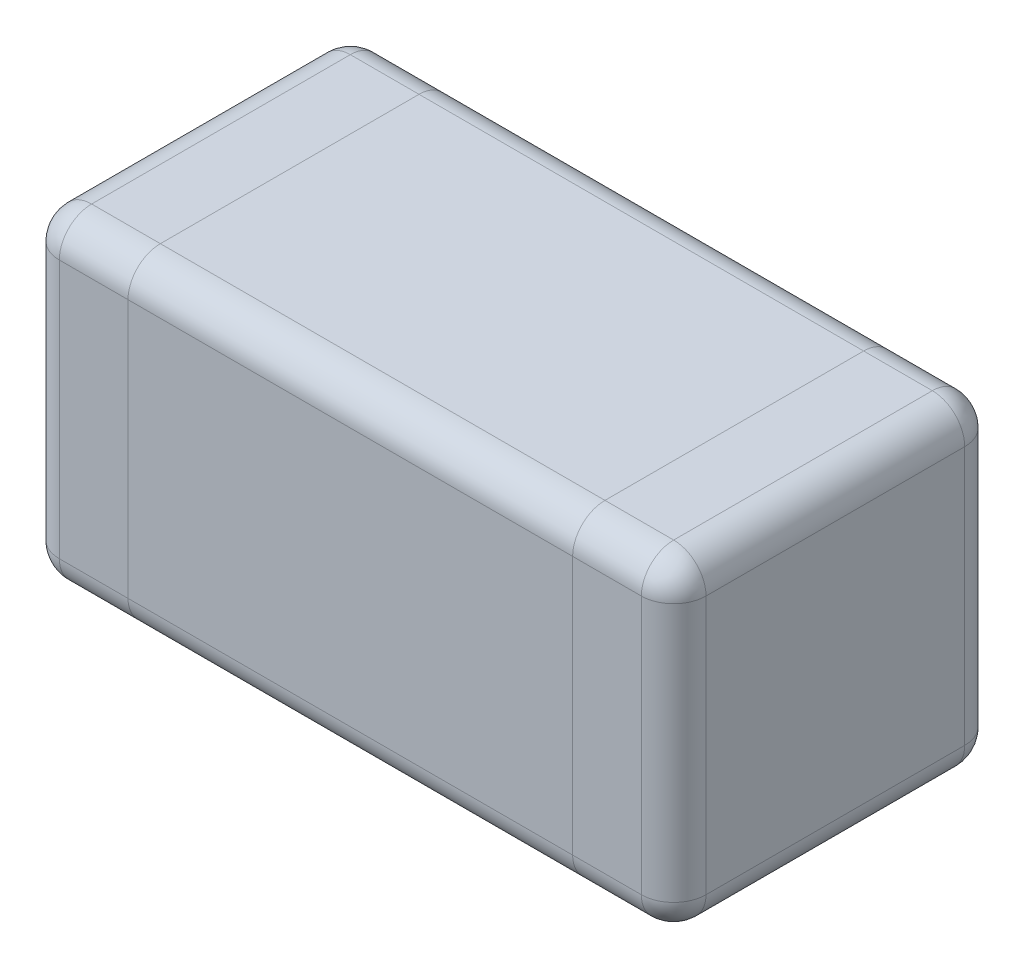
ISO-10303-21;
HEADER;
FILE_DESCRIPTION(('STEP AP214'),'2;1');
FILE_NAME('part.step','',(''),(''),'','','');
FILE_SCHEMA(('AUTOMOTIVE_DESIGN { 1 0 10303 214 1 1 1 1 }'));
ENDSEC;
DATA;
#1=APPLICATION_CONTEXT('core data for automotive mechanical design processes');
#2=APPLICATION_PROTOCOL_DEFINITION('international standard','automotive_design',2000,#1);
#3=PRODUCT_CONTEXT('',#1,'mechanical');
#4=PRODUCT('Part','Part','',(#3));
#5=PRODUCT_RELATED_PRODUCT_CATEGORY('part','',(#4));
#6=PRODUCT_DEFINITION_FORMATION('','',#4);
#7=PRODUCT_DEFINITION_CONTEXT('part definition',#1,'design');
#8=PRODUCT_DEFINITION('design','',#6,#7);
#9=PRODUCT_DEFINITION_SHAPE('','',#8);
#10=(LENGTH_UNIT() NAMED_UNIT(*) SI_UNIT(.MILLI.,.METRE.));
#11=(NAMED_UNIT(*) PLANE_ANGLE_UNIT() SI_UNIT($,.RADIAN.));
#12=(NAMED_UNIT(*) SI_UNIT($,.STERADIAN.) SOLID_ANGLE_UNIT());
#13=UNCERTAINTY_MEASURE_WITH_UNIT(LENGTH_MEASURE(1.E-05),#10,'distance_accuracy_value','');
#14=(GEOMETRIC_REPRESENTATION_CONTEXT(3) GLOBAL_UNCERTAINTY_ASSIGNED_CONTEXT((#13)) GLOBAL_UNIT_ASSIGNED_CONTEXT((#10,
#11,#12)) REPRESENTATION_CONTEXT('',''));
#15=CARTESIAN_POINT('',(0.,0.,0.));
#16=DIRECTION('',(0.,0.,1.));
#17=DIRECTION('',(1.,0.,0.));
#18=AXIS2_PLACEMENT_3D('',#15,#16,#17);
#19=CARTESIAN_POINT('',(0.,0.08,-0.08));
#20=DIRECTION('',(-1.,0.,0.));
#21=DIRECTION('',(0.,0.,1.));
#22=AXIS2_PLACEMENT_3D('',#19,#20,#21);
#23=CYLINDRICAL_SURFACE('',#22,0.08);
#24=DIRECTION('',(1.,0.,0.));
#25=VECTOR('',#24,1.);
#26=CARTESIAN_POINT('',(1.6,0.08,0.));
#27=LINE('',#26,#25);
#28=CARTESIAN_POINT('',(1.35,0.08,0.));
#29=VERTEX_POINT('',#28);
#30=CARTESIAN_POINT('',(1.52,0.08,0.));
#31=VERTEX_POINT('',#30);
#32=EDGE_CURVE('E233',#29,#31,#27,.T.);
#33=ORIENTED_EDGE('',*,*,#32,.F.);
#34=CARTESIAN_POINT('',(1.35,0.08,-0.08));
#35=DIRECTION('',(-1.,0.,0.));
#36=DIRECTION('',(0.,0.,1.));
#37=AXIS2_PLACEMENT_3D('',#34,#35,#36);
#38=CIRCLE('',#37,0.08);
#39=CARTESIAN_POINT('',(1.35,0.,-0.08));
#40=VERTEX_POINT('',#39);
#41=EDGE_CURVE('E12',#29,#40,#38,.F.);
#42=ORIENTED_EDGE('',*,*,#41,.T.);
#43=DIRECTION('',(1.,0.,0.));
#44=VECTOR('',#43,1.);
#45=CARTESIAN_POINT('',(0.,0.,-0.08));
#46=LINE('',#45,#44);
#47=CARTESIAN_POINT('',(1.52,0.,-0.08));
#48=VERTEX_POINT('',#47);
#49=EDGE_CURVE('E270',#48,#40,#46,.F.);
#50=ORIENTED_EDGE('',*,*,#49,.F.);
#51=CARTESIAN_POINT('',(1.52,0.08,-0.08));
#52=DIRECTION('',(1.,0.,0.));
#53=DIRECTION('',(0.,0.,-1.));
#54=AXIS2_PLACEMENT_3D('',#51,#52,#53);
#55=CIRCLE('',#54,0.08);
#56=EDGE_CURVE('E292',#31,#48,#55,.T.);
#57=ORIENTED_EDGE('',*,*,#56,.F.);
#58=EDGE_LOOP('',(#33,#42,#50,#57));
#59=FACE_BOUND('',#58,.T.);
#60=ADVANCED_FACE('F39',(#59),#23,.T.);
#61=CARTESIAN_POINT('',(0.,0.,0.));
#62=DIRECTION('',(0.,-1.,0.));
#63=DIRECTION('',(0.,0.,-1.));
#64=AXIS2_PLACEMENT_3D('',#61,#62,#63);
#65=PLANE('',#64);
#66=ORIENTED_EDGE('',*,*,#49,.T.);
#67=DIRECTION('',(0.,0.,-1.));
#68=VECTOR('',#67,1.);
#69=CARTESIAN_POINT('',(1.35,0.,0.));
#70=LINE('',#69,#68);
#71=CARTESIAN_POINT('',(1.35,0.,-0.719999999999999));
#72=VERTEX_POINT('',#71);
#73=EDGE_CURVE('E49',#40,#72,#70,.T.);
#74=ORIENTED_EDGE('',*,*,#73,.T.);
#75=DIRECTION('',(-1.,0.,0.));
#76=VECTOR('',#75,1.);
#77=CARTESIAN_POINT('',(1.6,0.,-0.719999999999999));
#78=LINE('',#77,#76);
#79=CARTESIAN_POINT('',(1.52,0.,-0.719999999999999));
#80=VERTEX_POINT('',#79);
#81=EDGE_CURVE('E262',#72,#80,#78,.F.);
#82=ORIENTED_EDGE('',*,*,#81,.T.);
#83=DIRECTION('',(0.,0.,-1.));
#84=VECTOR('',#83,1.);
#85=CARTESIAN_POINT('',(1.52,0.,0.));
#86=LINE('',#85,#84);
#87=EDGE_CURVE('E266',#80,#48,#86,.F.);
#88=ORIENTED_EDGE('',*,*,#87,.T.);
#89=EDGE_LOOP('',(#66,#74,#82,#88));
#90=FACE_BOUND('',#89,.T.);
#91=ADVANCED_FACE('F481',(#90),#65,.T.);
#92=CARTESIAN_POINT('',(0.,0.08,-0.719999999999999));
#93=DIRECTION('',(1.,0.,0.));
#94=DIRECTION('',(0.,0.,-1.));
#95=AXIS2_PLACEMENT_3D('',#92,#93,#94);
#96=CYLINDRICAL_SURFACE('',#95,0.08);
#97=ORIENTED_EDGE('',*,*,#81,.F.);
#98=CARTESIAN_POINT('',(1.35,0.08,-0.719999999999999));
#99=DIRECTION('',(-1.,0.,0.));
#100=DIRECTION('',(0.,0.,1.));
#101=AXIS2_PLACEMENT_3D('',#98,#99,#100);
#102=CIRCLE('',#101,0.08);
#103=CARTESIAN_POINT('',(1.35,0.08,-0.799999999999999));
#104=VERTEX_POINT('',#103);
#105=EDGE_CURVE('E377',#72,#104,#102,.F.);
#106=ORIENTED_EDGE('',*,*,#105,.T.);
#107=DIRECTION('',(-1.,0.,0.));
#108=VECTOR('',#107,1.);
#109=CARTESIAN_POINT('',(0.,0.08,-0.799999999999999));
#110=LINE('',#109,#108);
#111=CARTESIAN_POINT('',(1.52,0.08,-0.799999999999999));
#112=VERTEX_POINT('',#111);
#113=EDGE_CURVE('E247',#112,#104,#110,.T.);
#114=ORIENTED_EDGE('',*,*,#113,.F.);
#115=CARTESIAN_POINT('',(1.52,0.08,-0.719999999999999));
#116=DIRECTION('',(1.,0.,0.));
#117=DIRECTION('',(0.,0.,-1.));
#118=AXIS2_PLACEMENT_3D('',#115,#116,#117);
#119=CIRCLE('',#118,0.08);
#120=EDGE_CURVE('E315',#80,#112,#119,.T.);
#121=ORIENTED_EDGE('',*,*,#120,.F.);
#122=EDGE_LOOP('',(#97,#106,#114,#121));
#123=FACE_BOUND('',#122,.T.);
#124=ADVANCED_FACE('F433',(#123),#96,.T.);
#125=CARTESIAN_POINT('',(0.,0.8,-0.799999999999999));
#126=DIRECTION('',(0.,0.,1.));
#127=DIRECTION('',(1.,0.,0.));
#128=AXIS2_PLACEMENT_3D('',#125,#126,#127);
#129=PLANE('',#128);
#130=DIRECTION('',(0.,-1.,0.));
#131=VECTOR('',#130,1.);
#132=CARTESIAN_POINT('',(1.35,0.8,-0.799999999999999));
#133=LINE('',#132,#131);
#134=CARTESIAN_POINT('',(1.35,0.72,-0.799999999999999));
#135=VERTEX_POINT('',#134);
#136=EDGE_CURVE('E380',#135,#104,#133,.T.);
#137=ORIENTED_EDGE('',*,*,#136,.F.);
#138=DIRECTION('',(-1.,0.,0.));
#139=VECTOR('',#138,1.);
#140=CARTESIAN_POINT('',(0.,0.72,-0.799999999999999));
#141=LINE('',#140,#139);
#142=CARTESIAN_POINT('',(1.52,0.72,-0.799999999999999));
#143=VERTEX_POINT('',#142);
#144=EDGE_CURVE('E237',#135,#143,#141,.F.);
#145=ORIENTED_EDGE('',*,*,#144,.T.);
#146=DIRECTION('',(0.,-1.,0.));
#147=VECTOR('',#146,1.);
#148=CARTESIAN_POINT('',(1.52,0.8,-0.799999999999999));
#149=LINE('',#148,#147);
#150=EDGE_CURVE('E196',#143,#112,#149,.T.);
#151=ORIENTED_EDGE('',*,*,#150,.T.);
#152=ORIENTED_EDGE('',*,*,#113,.T.);
#153=EDGE_LOOP('',(#137,#145,#151,#152));
#154=FACE_BOUND('',#153,.T.);
#155=ADVANCED_FACE('F435',(#154),#129,.F.);
#156=CARTESIAN_POINT('',(0.,0.72,-0.719999999999999));
#157=DIRECTION('',(-1.,0.,0.));
#158=DIRECTION('',(0.,0.,1.));
#159=AXIS2_PLACEMENT_3D('',#156,#157,#158);
#160=CYLINDRICAL_SURFACE('',#159,0.08);
#161=ORIENTED_EDGE('',*,*,#144,.F.);
#162=CARTESIAN_POINT('',(1.35,0.72,-0.719999999999999));
#163=DIRECTION('',(-1.,0.,0.));
#164=DIRECTION('',(0.,0.,1.));
#165=AXIS2_PLACEMENT_3D('',#162,#163,#164);
#166=CIRCLE('',#165,0.08);
#167=CARTESIAN_POINT('',(1.35,0.8,-0.719999999999999));
#168=VERTEX_POINT('',#167);
#169=EDGE_CURVE('E373',#135,#168,#166,.F.);
#170=ORIENTED_EDGE('',*,*,#169,.T.);
#171=DIRECTION('',(-1.,0.,0.));
#172=VECTOR('',#171,1.);
#173=CARTESIAN_POINT('',(0.,0.8,-0.719999999999999));
#174=LINE('',#173,#172);
#175=CARTESIAN_POINT('',(1.52,0.8,-0.719999999999999));
#176=VERTEX_POINT('',#175);
#177=EDGE_CURVE('E283',#176,#168,#174,.T.);
#178=ORIENTED_EDGE('',*,*,#177,.F.);
#179=CARTESIAN_POINT('',(1.52,0.72,-0.719999999999999));
#180=DIRECTION('',(1.,0.,0.));
#181=DIRECTION('',(0.,0.,-1.));
#182=AXIS2_PLACEMENT_3D('',#179,#180,#181);
#183=CIRCLE('',#182,0.08);
#184=EDGE_CURVE('E200',#143,#176,#183,.T.);
#185=ORIENTED_EDGE('',*,*,#184,.F.);
#186=EDGE_LOOP('',(#161,#170,#178,#185));
#187=FACE_BOUND('',#186,.T.);
#188=ADVANCED_FACE('F465',(#187),#160,.T.);
#189=CARTESIAN_POINT('',(0.,0.8,0.));
#190=DIRECTION('',(0.,-1.,0.));
#191=DIRECTION('',(0.,0.,-1.));
#192=AXIS2_PLACEMENT_3D('',#189,#190,#191);
#193=PLANE('',#192);
#194=DIRECTION('',(0.,0.,-1.));
#195=VECTOR('',#194,1.);
#196=CARTESIAN_POINT('',(1.35,0.8,0.));
#197=LINE('',#196,#195);
#198=CARTESIAN_POINT('',(1.35,0.8,-0.08));
#199=VERTEX_POINT('',#198);
#200=EDGE_CURVE('E369',#199,#168,#197,.T.);
#201=ORIENTED_EDGE('',*,*,#200,.F.);
#202=DIRECTION('',(1.,0.,0.));
#203=VECTOR('',#202,1.);
#204=CARTESIAN_POINT('',(0.,0.8,-0.08));
#205=LINE('',#204,#203);
#206=CARTESIAN_POINT('',(1.52,0.8,-0.08));
#207=VERTEX_POINT('',#206);
#208=EDGE_CURVE('E275',#199,#207,#205,.T.);
#209=ORIENTED_EDGE('',*,*,#208,.T.);
#210=DIRECTION('',(0.,0.,-1.));
#211=VECTOR('',#210,1.);
#212=CARTESIAN_POINT('',(1.52,0.8,0.));
#213=LINE('',#212,#211);
#214=EDGE_CURVE('E279',#207,#176,#213,.T.);
#215=ORIENTED_EDGE('',*,*,#214,.T.);
#216=ORIENTED_EDGE('',*,*,#177,.T.);
#217=EDGE_LOOP('',(#201,#209,#215,#216));
#218=FACE_BOUND('',#217,.T.);
#219=ADVANCED_FACE('F464',(#218),#193,.F.);
#220=CARTESIAN_POINT('',(0.,0.72,-0.08));
#221=DIRECTION('',(1.,0.,0.));
#222=DIRECTION('',(0.,0.,-1.));
#223=AXIS2_PLACEMENT_3D('',#220,#221,#222);
#224=CYLINDRICAL_SURFACE('',#223,0.08);
#225=ORIENTED_EDGE('',*,*,#208,.F.);
#226=CARTESIAN_POINT('',(1.35,0.72,-0.08));
#227=DIRECTION('',(-1.,0.,0.));
#228=DIRECTION('',(0.,0.,1.));
#229=AXIS2_PLACEMENT_3D('',#226,#227,#228);
#230=CIRCLE('',#229,0.08);
#231=CARTESIAN_POINT('',(1.35,0.72,0.));
#232=VERTEX_POINT('',#231);
#233=EDGE_CURVE('E374',#199,#232,#230,.F.);
#234=ORIENTED_EDGE('',*,*,#233,.T.);
#235=DIRECTION('',(1.,0.,0.));
#236=VECTOR('',#235,1.);
#237=CARTESIAN_POINT('',(0.,0.72,0.));
#238=LINE('',#237,#236);
#239=CARTESIAN_POINT('',(1.52,0.72,0.));
#240=VERTEX_POINT('',#239);
#241=EDGE_CURVE('E224',#240,#232,#238,.F.);
#242=ORIENTED_EDGE('',*,*,#241,.F.);
#243=CARTESIAN_POINT('',(1.52,0.72,-0.08));
#244=DIRECTION('',(1.,0.,0.));
#245=DIRECTION('',(0.,0.,-1.));
#246=AXIS2_PLACEMENT_3D('',#243,#244,#245);
#247=CIRCLE('',#246,0.08);
#248=EDGE_CURVE('E299',#207,#240,#247,.T.);
#249=ORIENTED_EDGE('',*,*,#248,.F.);
#250=EDGE_LOOP('',(#225,#234,#242,#249));
#251=FACE_BOUND('',#250,.T.);
#252=ADVANCED_FACE('F411',(#251),#224,.T.);
#253=CARTESIAN_POINT('',(0.,0.8,0.));
#254=DIRECTION('',(0.,0.,-1.));
#255=DIRECTION('',(-1.,0.,0.));
#256=AXIS2_PLACEMENT_3D('',#253,#254,#255);
#257=PLANE('',#256);
#258=DIRECTION('',(0.,1.,0.));
#259=VECTOR('',#258,1.);
#260=CARTESIAN_POINT('',(1.35,0.8,0.));
#261=LINE('',#260,#259);
#262=EDGE_CURVE('E43',#29,#232,#261,.T.);
#263=ORIENTED_EDGE('',*,*,#262,.F.);
#264=ORIENTED_EDGE('',*,*,#32,.T.);
#265=DIRECTION('',(0.,-1.,0.));
#266=VECTOR('',#265,1.);
#267=CARTESIAN_POINT('',(1.52,0.8,0.));
#268=LINE('',#267,#266);
#269=EDGE_CURVE('E230',#31,#240,#268,.F.);
#270=ORIENTED_EDGE('',*,*,#269,.T.);
#271=ORIENTED_EDGE('',*,*,#241,.T.);
#272=EDGE_LOOP('',(#263,#264,#270,#271));
#273=FACE_BOUND('',#272,.T.);
#274=ADVANCED_FACE('F408',(#273),#257,.F.);
#275=ORIENTED_EDGE('',*,*,#41,.F.);
#276=CARTESIAN_POINT('',(0.25,0.08,0.));
#277=VERTEX_POINT('',#276);
#278=EDGE_CURVE('E238',#277,#29,#27,.T.);
#279=ORIENTED_EDGE('',*,*,#278,.F.);
#280=CARTESIAN_POINT('',(0.25,0.08,-0.08));
#281=DIRECTION('',(-1.,0.,0.));
#282=DIRECTION('',(0.,0.,1.));
#283=AXIS2_PLACEMENT_3D('',#280,#281,#282);
#284=CIRCLE('',#283,0.08);
#285=CARTESIAN_POINT('',(0.25,0.,-0.08));
#286=VERTEX_POINT('',#285);
#287=EDGE_CURVE('E348',#277,#286,#284,.F.);
#288=ORIENTED_EDGE('',*,*,#287,.T.);
#289=EDGE_CURVE('E273',#40,#286,#46,.F.);
#290=ORIENTED_EDGE('',*,*,#289,.F.);
#291=EDGE_LOOP('',(#275,#279,#288,#290));
#292=FACE_BOUND('',#291,.T.);
#293=ADVANCED_FACE('F483',(#292),#23,.T.);
#294=ORIENTED_EDGE('',*,*,#73,.F.);
#295=ORIENTED_EDGE('',*,*,#289,.T.);
#296=DIRECTION('',(0.,0.,-1.));
#297=VECTOR('',#296,1.);
#298=CARTESIAN_POINT('',(0.25,0.,0.));
#299=LINE('',#298,#297);
#300=CARTESIAN_POINT('',(0.25,0.,-0.719999999999999));
#301=VERTEX_POINT('',#300);
#302=EDGE_CURVE('E345',#286,#301,#299,.T.);
#303=ORIENTED_EDGE('',*,*,#302,.T.);
#304=EDGE_CURVE('E267',#301,#72,#78,.F.);
#305=ORIENTED_EDGE('',*,*,#304,.T.);
#306=EDGE_LOOP('',(#294,#295,#303,#305));
#307=FACE_BOUND('',#306,.T.);
#308=ADVANCED_FACE('F489',(#307),#65,.T.);
#309=ORIENTED_EDGE('',*,*,#105,.F.);
#310=ORIENTED_EDGE('',*,*,#304,.F.);
#311=CARTESIAN_POINT('',(0.25,0.08,-0.719999999999999));
#312=DIRECTION('',(-1.,0.,0.));
#313=DIRECTION('',(0.,0.,1.));
#314=AXIS2_PLACEMENT_3D('',#311,#312,#313);
#315=CIRCLE('',#314,0.08);
#316=CARTESIAN_POINT('',(0.25,0.08,-0.799999999999999));
#317=VERTEX_POINT('',#316);
#318=EDGE_CURVE('E349',#301,#317,#315,.F.);
#319=ORIENTED_EDGE('',*,*,#318,.T.);
#320=EDGE_CURVE('E251',#104,#317,#110,.T.);
#321=ORIENTED_EDGE('',*,*,#320,.F.);
#322=EDGE_LOOP('',(#309,#310,#319,#321));
#323=FACE_BOUND('',#322,.T.);
#324=ADVANCED_FACE('F530',(#323),#96,.T.);
#325=CARTESIAN_POINT('',(0.25,0.72,-0.799999999999999));
#326=VERTEX_POINT('',#325);
#327=EDGE_CURVE('E243',#326,#135,#141,.F.);
#328=ORIENTED_EDGE('',*,*,#327,.T.);
#329=ORIENTED_EDGE('',*,*,#136,.T.);
#330=ORIENTED_EDGE('',*,*,#320,.T.);
#331=DIRECTION('',(0.,-1.,0.));
#332=VECTOR('',#331,1.);
#333=CARTESIAN_POINT('',(0.25,0.8,-0.799999999999999));
#334=LINE('',#333,#332);
#335=EDGE_CURVE('E353',#326,#317,#334,.T.);
#336=ORIENTED_EDGE('',*,*,#335,.F.);
#337=EDGE_LOOP('',(#328,#329,#330,#336));
#338=FACE_BOUND('',#337,.T.);
#339=ADVANCED_FACE('F442',(#338),#129,.F.);
#340=ORIENTED_EDGE('',*,*,#169,.F.);
#341=ORIENTED_EDGE('',*,*,#327,.F.);
#342=CARTESIAN_POINT('',(0.25,0.72,-0.719999999999999));
#343=DIRECTION('',(-1.,0.,0.));
#344=DIRECTION('',(0.,0.,1.));
#345=AXIS2_PLACEMENT_3D('',#342,#343,#344);
#346=CIRCLE('',#345,0.08);
#347=CARTESIAN_POINT('',(0.25,0.8,-0.719999999999999));
#348=VERTEX_POINT('',#347);
#349=EDGE_CURVE('E343',#326,#348,#346,.F.);
#350=ORIENTED_EDGE('',*,*,#349,.T.);
#351=EDGE_CURVE('E287',#168,#348,#174,.T.);
#352=ORIENTED_EDGE('',*,*,#351,.F.);
#353=EDGE_LOOP('',(#340,#341,#350,#352));
#354=FACE_BOUND('',#353,.T.);
#355=ADVANCED_FACE('F446',(#354),#160,.T.);
#356=CARTESIAN_POINT('',(0.25,0.8,-0.08));
#357=VERTEX_POINT('',#356);
#358=EDGE_CURVE('E280',#357,#199,#205,.T.);
#359=ORIENTED_EDGE('',*,*,#358,.T.);
#360=ORIENTED_EDGE('',*,*,#200,.T.);
#361=ORIENTED_EDGE('',*,*,#351,.T.);
#362=DIRECTION('',(0.,0.,-1.));
#363=VECTOR('',#362,1.);
#364=CARTESIAN_POINT('',(0.25,0.8,0.));
#365=LINE('',#364,#363);
#366=EDGE_CURVE('E339',#357,#348,#365,.T.);
#367=ORIENTED_EDGE('',*,*,#366,.F.);
#368=EDGE_LOOP('',(#359,#360,#361,#367));
#369=FACE_BOUND('',#368,.T.);
#370=ADVANCED_FACE('F461',(#369),#193,.F.);
#371=ORIENTED_EDGE('',*,*,#233,.F.);
#372=ORIENTED_EDGE('',*,*,#358,.F.);
#373=CARTESIAN_POINT('',(0.25,0.72,-0.08));
#374=DIRECTION('',(-1.,0.,0.));
#375=DIRECTION('',(0.,0.,1.));
#376=AXIS2_PLACEMENT_3D('',#373,#374,#375);
#377=CIRCLE('',#376,0.08);
#378=CARTESIAN_POINT('',(0.25,0.72,0.));
#379=VERTEX_POINT('',#378);
#380=EDGE_CURVE('E344',#357,#379,#377,.F.);
#381=ORIENTED_EDGE('',*,*,#380,.T.);
#382=EDGE_CURVE('E228',#232,#379,#238,.F.);
#383=ORIENTED_EDGE('',*,*,#382,.F.);
#384=EDGE_LOOP('',(#371,#372,#381,#383));
#385=FACE_BOUND('',#384,.T.);
#386=ADVANCED_FACE('F405',(#385),#224,.T.);
#387=ORIENTED_EDGE('',*,*,#278,.T.);
#388=ORIENTED_EDGE('',*,*,#262,.T.);
#389=ORIENTED_EDGE('',*,*,#382,.T.);
#390=DIRECTION('',(0.,1.,0.));
#391=VECTOR('',#390,1.);
#392=CARTESIAN_POINT('',(0.25,0.8,0.));
#393=LINE('',#392,#391);
#394=EDGE_CURVE('E286',#277,#379,#393,.T.);
#395=ORIENTED_EDGE('',*,*,#394,.F.);
#396=EDGE_LOOP('',(#387,#388,#389,#395));
#397=FACE_BOUND('',#396,.T.);
#398=ADVANCED_FACE('F400',(#397),#257,.F.);
#399=CARTESIAN_POINT('',(0.,0.8,0.));
#400=DIRECTION('',(1.,0.,0.));
#401=DIRECTION('',(0.,0.,-1.));
#402=AXIS2_PLACEMENT_3D('',#399,#400,#401);
#403=PLANE('',#402);
#404=DIRECTION('',(0.,-1.,0.));
#405=VECTOR('',#404,1.);
#406=CARTESIAN_POINT('',(0.,0.8,-0.719999999999999));
#407=LINE('',#406,#405);
#408=CARTESIAN_POINT('',(0.,0.72,-0.719999999999999));
#409=VERTEX_POINT('',#408);
#410=CARTESIAN_POINT('',(0.,0.08,-0.719999999999999));
#411=VERTEX_POINT('',#410);
#412=EDGE_CURVE('E255',#409,#411,#407,.T.);
#413=ORIENTED_EDGE('',*,*,#412,.T.);
#414=DIRECTION('',(0.,0.,1.));
#415=VECTOR('',#414,1.);
#416=CARTESIAN_POINT('',(0.,0.08,0.));
#417=LINE('',#416,#415);
#418=CARTESIAN_POINT('',(0.,0.08,-0.08));
#419=VERTEX_POINT('',#418);
#420=EDGE_CURVE('E258',#411,#419,#417,.T.);
#421=ORIENTED_EDGE('',*,*,#420,.T.);
#422=DIRECTION('',(0.,-1.,0.));
#423=VECTOR('',#422,1.);
#424=CARTESIAN_POINT('',(0.,0.8,-0.08));
#425=LINE('',#424,#423);
#426=CARTESIAN_POINT('',(0.,0.72,-0.08));
#427=VERTEX_POINT('',#426);
#428=EDGE_CURVE('E253',#419,#427,#425,.F.);
#429=ORIENTED_EDGE('',*,*,#428,.T.);
#430=DIRECTION('',(0.,0.,1.));
#431=VECTOR('',#430,1.);
#432=CARTESIAN_POINT('',(0.,0.72,0.));
#433=LINE('',#432,#431);
#434=EDGE_CURVE('E250',#427,#409,#433,.F.);
#435=ORIENTED_EDGE('',*,*,#434,.T.);
#436=EDGE_LOOP('',(#413,#421,#429,#435));
#437=FACE_BOUND('',#436,.T.);
#438=ADVANCED_FACE('F571',(#437),#403,.F.);
#439=CARTESIAN_POINT('',(0.08,0.08,0.));
#440=VERTEX_POINT('',#439);
#441=EDGE_CURVE('E234',#440,#277,#27,.T.);
#442=ORIENTED_EDGE('',*,*,#441,.T.);
#443=ORIENTED_EDGE('',*,*,#394,.T.);
#444=CARTESIAN_POINT('',(0.08,0.72,0.));
#445=VERTEX_POINT('',#444);
#446=EDGE_CURVE('E223',#379,#445,#238,.F.);
#447=ORIENTED_EDGE('',*,*,#446,.T.);
#448=DIRECTION('',(0.,-1.,0.));
#449=VECTOR('',#448,1.);
#450=CARTESIAN_POINT('',(0.08,0.8,0.));
#451=LINE('',#450,#449);
#452=EDGE_CURVE('E227',#445,#440,#451,.T.);
#453=ORIENTED_EDGE('',*,*,#452,.T.);
#454=EDGE_LOOP('',(#442,#443,#447,#453));
#455=FACE_BOUND('',#454,.T.);
#456=ADVANCED_FACE('F507',(#455),#257,.F.);
#457=CARTESIAN_POINT('',(1.6,0.8,0.));
#458=DIRECTION('',(-1.,0.,0.));
#459=DIRECTION('',(0.,0.,1.));
#460=AXIS2_PLACEMENT_3D('',#457,#458,#459);
#461=PLANE('',#460);
#462=DIRECTION('',(0.,-1.,0.));
#463=VECTOR('',#462,1.);
#464=CARTESIAN_POINT('',(1.6,0.8,-0.08));
#465=LINE('',#464,#463);
#466=CARTESIAN_POINT('',(1.6,0.72,-0.08));
#467=VERTEX_POINT('',#466);
#468=CARTESIAN_POINT('',(1.6,0.08,-0.08));
#469=VERTEX_POINT('',#468);
#470=EDGE_CURVE('E188',#467,#469,#465,.T.);
#471=ORIENTED_EDGE('',*,*,#470,.T.);
#472=DIRECTION('',(0.,0.,-1.));
#473=VECTOR('',#472,1.);
#474=CARTESIAN_POINT('',(1.6,0.08,-0.799999999999999));
#475=LINE('',#474,#473);
#476=CARTESIAN_POINT('',(1.6,0.08,-0.719999999999999));
#477=VERTEX_POINT('',#476);
#478=EDGE_CURVE('E184',#469,#477,#475,.T.);
#479=ORIENTED_EDGE('',*,*,#478,.T.);
#480=DIRECTION('',(0.,-1.,0.));
#481=VECTOR('',#480,1.);
#482=CARTESIAN_POINT('',(1.6,0.8,-0.719999999999999));
#483=LINE('',#482,#481);
#484=CARTESIAN_POINT('',(1.6,0.72,-0.719999999999999));
#485=VERTEX_POINT('',#484);
#486=EDGE_CURVE('E176',#477,#485,#483,.F.);
#487=ORIENTED_EDGE('',*,*,#486,.T.);
#488=DIRECTION('',(0.,0.,-1.));
#489=VECTOR('',#488,1.);
#490=CARTESIAN_POINT('',(1.6,0.72,0.));
#491=LINE('',#490,#489);
#492=EDGE_CURVE('E181',#485,#467,#491,.F.);
#493=ORIENTED_EDGE('',*,*,#492,.T.);
#494=EDGE_LOOP('',(#471,#479,#487,#493));
#495=FACE_BOUND('',#494,.T.);
#496=ADVANCED_FACE('F179',(#495),#461,.F.);
#497=CARTESIAN_POINT('',(0.08,0.72,-0.799999999999999));
#498=VERTEX_POINT('',#497);
#499=EDGE_CURVE('E239',#498,#326,#141,.F.);
#500=ORIENTED_EDGE('',*,*,#499,.T.);
#501=ORIENTED_EDGE('',*,*,#335,.T.);
#502=CARTESIAN_POINT('',(0.08,0.08,-0.799999999999999));
#503=VERTEX_POINT('',#502);
#504=EDGE_CURVE('E246',#317,#503,#110,.T.);
#505=ORIENTED_EDGE('',*,*,#504,.T.);
#506=DIRECTION('',(0.,-1.,0.));
#507=VECTOR('',#506,1.);
#508=CARTESIAN_POINT('',(0.08,0.8,-0.799999999999999));
#509=LINE('',#508,#507);
#510=EDGE_CURVE('E242',#503,#498,#509,.F.);
#511=ORIENTED_EDGE('',*,*,#510,.T.);
#512=EDGE_LOOP('',(#500,#501,#505,#511));
#513=FACE_BOUND('',#512,.T.);
#514=ADVANCED_FACE('F450',(#513),#129,.F.);
#515=CARTESIAN_POINT('',(0.08,0.8,-0.08));
#516=VERTEX_POINT('',#515);
#517=EDGE_CURVE('E276',#516,#357,#205,.T.);
#518=ORIENTED_EDGE('',*,*,#517,.T.);
#519=ORIENTED_EDGE('',*,*,#366,.T.);
#520=CARTESIAN_POINT('',(0.08,0.8,-0.719999999999999));
#521=VERTEX_POINT('',#520);
#522=EDGE_CURVE('E282',#348,#521,#174,.T.);
#523=ORIENTED_EDGE('',*,*,#522,.T.);
#524=DIRECTION('',(0.,0.,1.));
#525=VECTOR('',#524,1.);
#526=CARTESIAN_POINT('',(0.08,0.8,0.));
#527=LINE('',#526,#525);
#528=EDGE_CURVE('E272',#521,#516,#527,.T.);
#529=ORIENTED_EDGE('',*,*,#528,.T.);
#530=EDGE_LOOP('',(#518,#519,#523,#529));
#531=FACE_BOUND('',#530,.T.);
#532=ADVANCED_FACE('F473',(#531),#193,.F.);
#533=ORIENTED_EDGE('',*,*,#302,.F.);
#534=CARTESIAN_POINT('',(0.08,0.,-0.08));
#535=VERTEX_POINT('',#534);
#536=EDGE_CURVE('E269',#286,#535,#46,.F.);
#537=ORIENTED_EDGE('',*,*,#536,.T.);
#538=DIRECTION('',(0.,0.,1.));
#539=VECTOR('',#538,1.);
#540=CARTESIAN_POINT('',(0.08,0.,-0.799999999999999));
#541=LINE('',#540,#539);
#542=CARTESIAN_POINT('',(0.08,0.,-0.719999999999999));
#543=VERTEX_POINT('',#542);
#544=EDGE_CURVE('E260',#535,#543,#541,.F.);
#545=ORIENTED_EDGE('',*,*,#544,.T.);
#546=EDGE_CURVE('E263',#543,#301,#78,.F.);
#547=ORIENTED_EDGE('',*,*,#546,.T.);
#548=EDGE_LOOP('',(#533,#537,#545,#547));
#549=FACE_BOUND('',#548,.T.);
#550=ADVANCED_FACE('F490',(#549),#65,.T.);
#551=CARTESIAN_POINT('',(0.08,0.8,-0.719999999999999));
#552=DIRECTION('',(0.,-1.,0.));
#553=DIRECTION('',(0.,0.,-1.));
#554=AXIS2_PLACEMENT_3D('',#551,#552,#553);
#555=CYLINDRICAL_SURFACE('',#554,0.08);
#556=CARTESIAN_POINT('',(0.08,0.72,-0.719999999999999));
#557=DIRECTION('',(0.,1.,0.));
#558=DIRECTION('',(0.,0.,1.));
#559=AXIS2_PLACEMENT_3D('',#556,#557,#558);
#560=CIRCLE('',#559,0.08);
#561=EDGE_CURVE('E215',#498,#409,#560,.T.);
#562=ORIENTED_EDGE('',*,*,#561,.F.);
#563=ORIENTED_EDGE('',*,*,#510,.F.);
#564=CARTESIAN_POINT('',(0.08,0.08,-0.719999999999999));
#565=DIRECTION('',(0.,-1.,0.));
#566=DIRECTION('',(0.,0.,-1.));
#567=AXIS2_PLACEMENT_3D('',#564,#565,#566);
#568=CIRCLE('',#567,0.08);
#569=EDGE_CURVE('E218',#411,#503,#568,.T.);
#570=ORIENTED_EDGE('',*,*,#569,.F.);
#571=ORIENTED_EDGE('',*,*,#412,.F.);
#572=EDGE_LOOP('',(#562,#563,#570,#571));
#573=FACE_BOUND('',#572,.T.);
#574=ADVANCED_FACE('F41',(#573),#555,.T.);
#575=CARTESIAN_POINT('',(0.08,0.72,-0.719999999999999));
#576=DIRECTION('',(0.,0.,1.));
#577=DIRECTION('',(1.,0.,0.));
#578=AXIS2_PLACEMENT_3D('',#575,#576,#577);
#579=SPHERICAL_SURFACE('',#578,0.08);
#580=CARTESIAN_POINT('',(0.08,0.72,-0.719999999999999));
#581=DIRECTION('',(-1.,0.,0.));
#582=DIRECTION('',(0.,0.,1.));
#583=AXIS2_PLACEMENT_3D('',#580,#581,#582);
#584=CIRCLE('',#583,0.08);
#585=EDGE_CURVE('E331',#498,#521,#584,.F.);
#586=ORIENTED_EDGE('',*,*,#585,.F.);
#587=ORIENTED_EDGE('',*,*,#561,.T.);
#588=CARTESIAN_POINT('',(0.08,0.72,-0.719999999999999));
#589=DIRECTION('',(0.,0.,-1.));
#590=DIRECTION('',(0.,1.,0.));
#591=AXIS2_PLACEMENT_3D('',#588,#589,#590);
#592=CIRCLE('',#591,0.08);
#593=EDGE_CURVE('E334',#521,#409,#592,.F.);
#594=ORIENTED_EDGE('',*,*,#593,.F.);
#595=EDGE_LOOP('',(#586,#587,#594));
#596=FACE_BOUND('',#595,.T.);
#597=ADVANCED_FACE('F558',(#596),#579,.T.);
#598=CARTESIAN_POINT('',(0.08,0.08,-0.719999999999999));
#599=DIRECTION('',(0.,0.,1.));
#600=DIRECTION('',(1.,0.,0.));
#601=AXIS2_PLACEMENT_3D('',#598,#599,#600);
#602=SPHERICAL_SURFACE('',#601,0.08);
#603=CARTESIAN_POINT('',(0.08,0.08,-0.719999999999999));
#604=DIRECTION('',(0.,0.,-1.));
#605=DIRECTION('',(-1.,0.,0.));
#606=AXIS2_PLACEMENT_3D('',#603,#604,#605);
#607=CIRCLE('',#606,0.08);
#608=EDGE_CURVE('E325',#411,#543,#607,.F.);
#609=ORIENTED_EDGE('',*,*,#608,.F.);
#610=ORIENTED_EDGE('',*,*,#569,.T.);
#611=CARTESIAN_POINT('',(0.08,0.08,-0.719999999999999));
#612=DIRECTION('',(-1.,0.,0.));
#613=DIRECTION('',(0.,0.,1.));
#614=AXIS2_PLACEMENT_3D('',#611,#612,#613);
#615=CIRCLE('',#614,0.08);
#616=EDGE_CURVE('E328',#543,#503,#615,.F.);
#617=ORIENTED_EDGE('',*,*,#616,.F.);
#618=EDGE_LOOP('',(#609,#610,#617));
#619=FACE_BOUND('',#618,.T.);
#620=ADVANCED_FACE('F536',(#619),#602,.T.);
#621=CARTESIAN_POINT('',(0.08,0.72,0.));
#622=DIRECTION('',(0.,0.,1.));
#623=DIRECTION('',(1.,0.,0.));
#624=AXIS2_PLACEMENT_3D('',#621,#622,#623);
#625=CYLINDRICAL_SURFACE('',#624,0.08);
#626=ORIENTED_EDGE('',*,*,#593,.T.);
#627=ORIENTED_EDGE('',*,*,#434,.F.);
#628=CARTESIAN_POINT('',(0.08,0.72,-0.08));
#629=DIRECTION('',(0.,0.,1.));
#630=DIRECTION('',(1.,0.,0.));
#631=AXIS2_PLACEMENT_3D('',#628,#629,#630);
#632=CIRCLE('',#631,0.08);
#633=EDGE_CURVE('E319',#516,#427,#632,.T.);
#634=ORIENTED_EDGE('',*,*,#633,.F.);
#635=ORIENTED_EDGE('',*,*,#528,.F.);
#636=EDGE_LOOP('',(#626,#627,#634,#635));
#637=FACE_BOUND('',#636,.T.);
#638=ADVANCED_FACE('F479',(#637),#625,.T.);
#639=ORIENTED_EDGE('',*,*,#349,.F.);
#640=ORIENTED_EDGE('',*,*,#499,.F.);
#641=ORIENTED_EDGE('',*,*,#585,.T.);
#642=ORIENTED_EDGE('',*,*,#522,.F.);
#643=EDGE_LOOP('',(#639,#640,#641,#642));
#644=FACE_BOUND('',#643,.T.);
#645=ADVANCED_FACE('F455',(#644),#160,.T.);
#646=CARTESIAN_POINT('',(1.52,0.8,-0.719999999999999));
#647=DIRECTION('',(0.,-1.,0.));
#648=DIRECTION('',(0.,0.,-1.));
#649=AXIS2_PLACEMENT_3D('',#646,#647,#648);
#650=CYLINDRICAL_SURFACE('',#649,0.08);
#651=CARTESIAN_POINT('',(1.52,0.08,-0.719999999999999));
#652=DIRECTION('',(0.,-1.,0.));
#653=DIRECTION('',(0.,0.,-1.));
#654=AXIS2_PLACEMENT_3D('',#651,#652,#653);
#655=CIRCLE('',#654,0.08);
#656=EDGE_CURVE('E201',#112,#477,#655,.T.);
#657=ORIENTED_EDGE('',*,*,#656,.F.);
#658=ORIENTED_EDGE('',*,*,#150,.F.);
#659=CARTESIAN_POINT('',(1.52,0.72,-0.719999999999999));
#660=DIRECTION('',(0.,1.,0.));
#661=DIRECTION('',(0.,0.,1.));
#662=AXIS2_PLACEMENT_3D('',#659,#660,#661);
#663=CIRCLE('',#662,0.08);
#664=EDGE_CURVE('E192',#485,#143,#663,.T.);
#665=ORIENTED_EDGE('',*,*,#664,.F.);
#666=ORIENTED_EDGE('',*,*,#486,.F.);
#667=EDGE_LOOP('',(#657,#658,#665,#666));
#668=FACE_BOUND('',#667,.T.);
#669=ADVANCED_FACE('F194',(#668),#650,.T.);
#670=ORIENTED_EDGE('',*,*,#318,.F.);
#671=ORIENTED_EDGE('',*,*,#546,.F.);
#672=ORIENTED_EDGE('',*,*,#616,.T.);
#673=ORIENTED_EDGE('',*,*,#504,.F.);
#674=EDGE_LOOP('',(#670,#671,#672,#673));
#675=FACE_BOUND('',#674,.T.);
#676=ADVANCED_FACE('F537',(#675),#96,.T.);
#677=CARTESIAN_POINT('',(0.08,0.08,0.));
#678=DIRECTION('',(0.,0.,-1.));
#679=DIRECTION('',(-1.,0.,0.));
#680=AXIS2_PLACEMENT_3D('',#677,#678,#679);
#681=CYLINDRICAL_SURFACE('',#680,0.08);
#682=ORIENTED_EDGE('',*,*,#608,.T.);
#683=ORIENTED_EDGE('',*,*,#544,.F.);
#684=CARTESIAN_POINT('',(0.08,0.08,-0.08));
#685=DIRECTION('',(0.,0.,1.));
#686=DIRECTION('',(1.,0.,0.));
#687=AXIS2_PLACEMENT_3D('',#684,#685,#686);
#688=CIRCLE('',#687,0.08);
#689=EDGE_CURVE('E312',#419,#535,#688,.T.);
#690=ORIENTED_EDGE('',*,*,#689,.F.);
#691=ORIENTED_EDGE('',*,*,#420,.F.);
#692=EDGE_LOOP('',(#682,#683,#690,#691));
#693=FACE_BOUND('',#692,.T.);
#694=ADVANCED_FACE('F520',(#693),#681,.T.);
#695=CARTESIAN_POINT('',(0.08,0.8,-0.08));
#696=DIRECTION('',(0.,-1.,0.));
#697=DIRECTION('',(0.,0.,-1.));
#698=AXIS2_PLACEMENT_3D('',#695,#696,#697);
#699=CYLINDRICAL_SURFACE('',#698,0.08);
#700=CARTESIAN_POINT('',(0.08,0.72,-0.08));
#701=DIRECTION('',(0.,1.,0.));
#702=DIRECTION('',(0.,0.,1.));
#703=AXIS2_PLACEMENT_3D('',#700,#701,#702);
#704=CIRCLE('',#703,0.08);
#705=EDGE_CURVE('E322',#427,#445,#704,.T.);
#706=ORIENTED_EDGE('',*,*,#705,.F.);
#707=ORIENTED_EDGE('',*,*,#428,.F.);
#708=CARTESIAN_POINT('',(0.08,0.08,-0.08));
#709=DIRECTION('',(0.,-1.,0.));
#710=DIRECTION('',(0.,0.,-1.));
#711=AXIS2_PLACEMENT_3D('',#708,#709,#710);
#712=CIRCLE('',#711,0.08);
#713=EDGE_CURVE('E309',#440,#419,#712,.T.);
#714=ORIENTED_EDGE('',*,*,#713,.F.);
#715=ORIENTED_EDGE('',*,*,#452,.F.);
#716=EDGE_LOOP('',(#706,#707,#714,#715));
#717=FACE_BOUND('',#716,.T.);
#718=ADVANCED_FACE('F514',(#717),#699,.T.);
#719=CARTESIAN_POINT('',(0.08,0.72,-0.08));
#720=DIRECTION('',(0.,0.,1.));
#721=DIRECTION('',(1.,0.,0.));
#722=AXIS2_PLACEMENT_3D('',#719,#720,#721);
#723=SPHERICAL_SURFACE('',#722,0.08);
#724=ORIENTED_EDGE('',*,*,#633,.T.);
#725=ORIENTED_EDGE('',*,*,#705,.T.);
#726=CARTESIAN_POINT('',(0.08,0.72,-0.08));
#727=DIRECTION('',(-1.,0.,0.));
#728=DIRECTION('',(0.,-1.,0.));
#729=AXIS2_PLACEMENT_3D('',#726,#727,#728);
#730=CIRCLE('',#729,0.08);
#731=EDGE_CURVE('E208',#516,#445,#730,.F.);
#732=ORIENTED_EDGE('',*,*,#731,.F.);
#733=EDGE_LOOP('',(#724,#725,#732));
#734=FACE_BOUND('',#733,.T.);
#735=ADVANCED_FACE('F679',(#734),#723,.T.);
#736=CARTESIAN_POINT('',(1.52,0.72,-0.719999999999999));
#737=DIRECTION('',(0.,0.,1.));
#738=DIRECTION('',(1.,0.,0.));
#739=AXIS2_PLACEMENT_3D('',#736,#737,#738);
#740=SPHERICAL_SURFACE('',#739,0.08);
#741=ORIENTED_EDGE('',*,*,#664,.T.);
#742=ORIENTED_EDGE('',*,*,#184,.T.);
#743=CARTESIAN_POINT('',(1.52,0.72,-0.719999999999999));
#744=DIRECTION('',(0.,0.,-1.));
#745=DIRECTION('',(-1.,0.,0.));
#746=AXIS2_PLACEMENT_3D('',#743,#744,#745);
#747=CIRCLE('',#746,0.08);
#748=EDGE_CURVE('E204',#485,#176,#747,.F.);
#749=ORIENTED_EDGE('',*,*,#748,.F.);
#750=EDGE_LOOP('',(#741,#742,#749));
#751=FACE_BOUND('',#750,.T.);
#752=ADVANCED_FACE('F205',(#751),#740,.T.);
#753=CARTESIAN_POINT('',(1.52,0.08,-0.719999999999999));
#754=DIRECTION('',(0.,0.,1.));
#755=DIRECTION('',(1.,0.,0.));
#756=AXIS2_PLACEMENT_3D('',#753,#754,#755);
#757=SPHERICAL_SURFACE('',#756,0.08);
#758=ORIENTED_EDGE('',*,*,#120,.T.);
#759=ORIENTED_EDGE('',*,*,#656,.T.);
#760=CARTESIAN_POINT('',(1.52,0.08,-0.719999999999999));
#761=DIRECTION('',(0.,0.,-1.));
#762=DIRECTION('',(-1.,0.,0.));
#763=AXIS2_PLACEMENT_3D('',#760,#761,#762);
#764=CIRCLE('',#763,0.08);
#765=EDGE_CURVE('E209',#80,#477,#764,.F.);
#766=ORIENTED_EDGE('',*,*,#765,.F.);
#767=EDGE_LOOP('',(#758,#759,#766));
#768=FACE_BOUND('',#767,.T.);
#769=ADVANCED_FACE('F428',(#768),#757,.T.);
#770=CARTESIAN_POINT('',(0.08,0.08,-0.08));
#771=DIRECTION('',(0.,0.,1.));
#772=DIRECTION('',(1.,0.,0.));
#773=AXIS2_PLACEMENT_3D('',#770,#771,#772);
#774=SPHERICAL_SURFACE('',#773,0.08);
#775=ORIENTED_EDGE('',*,*,#713,.T.);
#776=ORIENTED_EDGE('',*,*,#689,.T.);
#777=CARTESIAN_POINT('',(0.08,0.08,-0.08));
#778=DIRECTION('',(-1.,0.,0.));
#779=DIRECTION('',(0.,0.,1.));
#780=AXIS2_PLACEMENT_3D('',#777,#778,#779);
#781=CIRCLE('',#780,0.08);
#782=EDGE_CURVE('E302',#440,#535,#781,.F.);
#783=ORIENTED_EDGE('',*,*,#782,.F.);
#784=EDGE_LOOP('',(#775,#776,#783));
#785=FACE_BOUND('',#784,.T.);
#786=ADVANCED_FACE('F517',(#785),#774,.T.);
#787=ORIENTED_EDGE('',*,*,#380,.F.);
#788=ORIENTED_EDGE('',*,*,#517,.F.);
#789=ORIENTED_EDGE('',*,*,#731,.T.);
#790=ORIENTED_EDGE('',*,*,#446,.F.);
#791=EDGE_LOOP('',(#787,#788,#789,#790));
#792=FACE_BOUND('',#791,.T.);
#793=ADVANCED_FACE('F567',(#792),#224,.T.);
#794=CARTESIAN_POINT('',(1.52,0.72,0.));
#795=DIRECTION('',(0.,0.,-1.));
#796=DIRECTION('',(-1.,0.,0.));
#797=AXIS2_PLACEMENT_3D('',#794,#795,#796);
#798=CYLINDRICAL_SURFACE('',#797,0.08);
#799=ORIENTED_EDGE('',*,*,#748,.T.);
#800=ORIENTED_EDGE('',*,*,#214,.F.);
#801=CARTESIAN_POINT('',(1.52,0.72,-0.08));
#802=DIRECTION('',(0.,0.,1.));
#803=DIRECTION('',(0.,-1.,0.));
#804=AXIS2_PLACEMENT_3D('',#801,#802,#803);
#805=CIRCLE('',#804,0.08);
#806=EDGE_CURVE('E213',#467,#207,#805,.T.);
#807=ORIENTED_EDGE('',*,*,#806,.F.);
#808=ORIENTED_EDGE('',*,*,#492,.F.);
#809=EDGE_LOOP('',(#799,#800,#807,#808));
#810=FACE_BOUND('',#809,.T.);
#811=ADVANCED_FACE('F211',(#810),#798,.T.);
#812=CARTESIAN_POINT('',(1.52,0.08,0.));
#813=DIRECTION('',(0.,0.,1.));
#814=DIRECTION('',(1.,0.,0.));
#815=AXIS2_PLACEMENT_3D('',#812,#813,#814);
#816=CYLINDRICAL_SURFACE('',#815,0.08);
#817=ORIENTED_EDGE('',*,*,#765,.T.);
#818=ORIENTED_EDGE('',*,*,#478,.F.);
#819=CARTESIAN_POINT('',(1.52,0.08,-0.08));
#820=DIRECTION('',(0.,0.,1.));
#821=DIRECTION('',(1.,0.,0.));
#822=AXIS2_PLACEMENT_3D('',#819,#820,#821);
#823=CIRCLE('',#822,0.08);
#824=EDGE_CURVE('E295',#48,#469,#823,.T.);
#825=ORIENTED_EDGE('',*,*,#824,.F.);
#826=ORIENTED_EDGE('',*,*,#87,.F.);
#827=EDGE_LOOP('',(#817,#818,#825,#826));
#828=FACE_BOUND('',#827,.T.);
#829=ADVANCED_FACE('F425',(#828),#816,.T.);
#830=ORIENTED_EDGE('',*,*,#287,.F.);
#831=ORIENTED_EDGE('',*,*,#441,.F.);
#832=ORIENTED_EDGE('',*,*,#782,.T.);
#833=ORIENTED_EDGE('',*,*,#536,.F.);
#834=EDGE_LOOP('',(#830,#831,#832,#833));
#835=FACE_BOUND('',#834,.T.);
#836=ADVANCED_FACE('F484',(#835),#23,.T.);
#837=CARTESIAN_POINT('',(1.52,0.72,-0.08));
#838=DIRECTION('',(0.,0.,1.));
#839=DIRECTION('',(1.,0.,0.));
#840=AXIS2_PLACEMENT_3D('',#837,#838,#839);
#841=SPHERICAL_SURFACE('',#840,0.08);
#842=ORIENTED_EDGE('',*,*,#806,.T.);
#843=ORIENTED_EDGE('',*,*,#248,.T.);
#844=CARTESIAN_POINT('',(1.52,0.72,-0.08));
#845=DIRECTION('',(0.,1.,0.));
#846=DIRECTION('',(0.,0.,1.));
#847=AXIS2_PLACEMENT_3D('',#844,#845,#846);
#848=CIRCLE('',#847,0.08);
#849=EDGE_CURVE('E290',#467,#240,#848,.F.);
#850=ORIENTED_EDGE('',*,*,#849,.F.);
#851=EDGE_LOOP('',(#842,#843,#850));
#852=FACE_BOUND('',#851,.T.);
#853=ADVANCED_FACE('F414',(#852),#841,.T.);
#854=CARTESIAN_POINT('',(1.52,0.08,-0.08));
#855=DIRECTION('',(0.,0.,1.));
#856=DIRECTION('',(1.,0.,0.));
#857=AXIS2_PLACEMENT_3D('',#854,#855,#856);
#858=SPHERICAL_SURFACE('',#857,0.08);
#859=ORIENTED_EDGE('',*,*,#56,.T.);
#860=ORIENTED_EDGE('',*,*,#824,.T.);
#861=CARTESIAN_POINT('',(1.52,0.08,-0.08));
#862=DIRECTION('',(0.,-1.,0.));
#863=DIRECTION('',(0.,0.,-1.));
#864=AXIS2_PLACEMENT_3D('',#861,#862,#863);
#865=CIRCLE('',#864,0.08);
#866=EDGE_CURVE('E288',#31,#469,#865,.F.);
#867=ORIENTED_EDGE('',*,*,#866,.F.);
#868=EDGE_LOOP('',(#859,#860,#867));
#869=FACE_BOUND('',#868,.T.);
#870=ADVANCED_FACE('F421',(#869),#858,.T.);
#871=CARTESIAN_POINT('',(1.52,0.8,-0.08));
#872=DIRECTION('',(0.,-1.,0.));
#873=DIRECTION('',(0.,0.,-1.));
#874=AXIS2_PLACEMENT_3D('',#871,#872,#873);
#875=CYLINDRICAL_SURFACE('',#874,0.08);
#876=ORIENTED_EDGE('',*,*,#849,.T.);
#877=ORIENTED_EDGE('',*,*,#269,.F.);
#878=ORIENTED_EDGE('',*,*,#866,.T.);
#879=ORIENTED_EDGE('',*,*,#470,.F.);
#880=EDGE_LOOP('',(#876,#877,#878,#879));
#881=FACE_BOUND('',#880,.T.);
#882=ADVANCED_FACE('F417',(#881),#875,.T.);
#883=CLOSED_SHELL('',(#60,#91,#124,#155,#188,#219,#252,#274,#293,#308,#324,#339,#355,#370,#386,
#398,#438,#456,#496,#514,#532,#550,#574,#597,#620,#638,#645,#669,#676,#694,#718,#735,#752,#769,
#786,#793,#811,#829,#836,#853,#870,#882));
#884=MANIFOLD_SOLID_BREP('B2',#883);
#885=ADVANCED_BREP_SHAPE_REPRESENTATION('',(#18,#884),#14);
#886=SHAPE_DEFINITION_REPRESENTATION(#9,#885);
ENDSEC;
END-ISO-10303-21;
